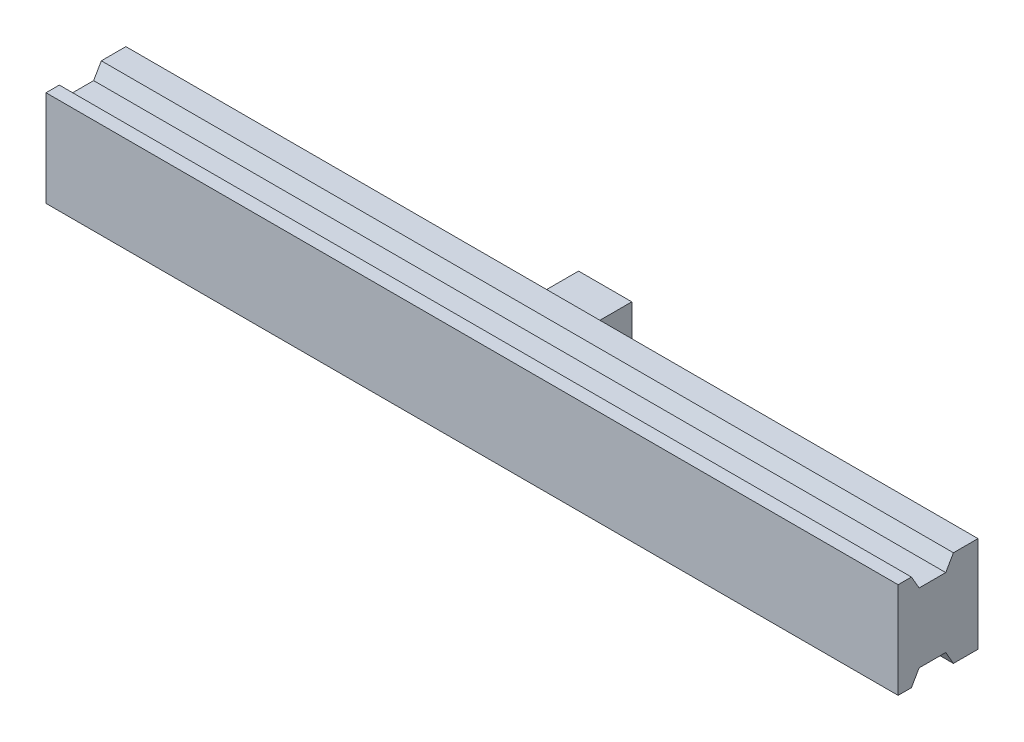
ISO-10303-21;
HEADER;
FILE_DESCRIPTION(('STEP AP214'),'2;1');
FILE_NAME('part.step','',(''),(''),'','','');
FILE_SCHEMA(('AUTOMOTIVE_DESIGN { 1 0 10303 214 1 1 1 1 }'));
ENDSEC;
DATA;
#1=APPLICATION_CONTEXT('core data for automotive mechanical design processes');
#2=APPLICATION_PROTOCOL_DEFINITION('international standard','automotive_design',2000,#1);
#3=PRODUCT_CONTEXT('',#1,'mechanical');
#4=PRODUCT('Part','Part','',(#3));
#5=PRODUCT_RELATED_PRODUCT_CATEGORY('part','',(#4));
#6=PRODUCT_DEFINITION_FORMATION('','',#4);
#7=PRODUCT_DEFINITION_CONTEXT('part definition',#1,'design');
#8=PRODUCT_DEFINITION('design','',#6,#7);
#9=PRODUCT_DEFINITION_SHAPE('','',#8);
#10=(LENGTH_UNIT() NAMED_UNIT(*) SI_UNIT(.MILLI.,.METRE.));
#11=(NAMED_UNIT(*) PLANE_ANGLE_UNIT() SI_UNIT($,.RADIAN.));
#12=(NAMED_UNIT(*) SI_UNIT($,.STERADIAN.) SOLID_ANGLE_UNIT());
#13=UNCERTAINTY_MEASURE_WITH_UNIT(LENGTH_MEASURE(1.E-05),#10,'distance_accuracy_value','');
#14=(GEOMETRIC_REPRESENTATION_CONTEXT(3) GLOBAL_UNCERTAINTY_ASSIGNED_CONTEXT((#13)) GLOBAL_UNIT_ASSIGNED_CONTEXT((#10,
#11,#12)) REPRESENTATION_CONTEXT('',''));
#15=CARTESIAN_POINT('',(0.,0.,0.));
#16=DIRECTION('',(0.,0.,1.));
#17=DIRECTION('',(1.,0.,0.));
#18=AXIS2_PLACEMENT_3D('',#15,#16,#17);
#19=CARTESIAN_POINT('',(0.,0.,0.));
#20=DIRECTION('',(0.,0.,1.));
#21=DIRECTION('',(1.,0.,0.));
#22=AXIS2_PLACEMENT_3D('',#19,#20,#21);
#23=PLANE('',#22);
#24=DIRECTION('',(0.,1.,0.));
#25=VECTOR('',#24,1.);
#26=CARTESIAN_POINT('',(495.087037167305,98.3824206282716,0.));
#27=LINE('',#26,#25);
#28=CARTESIAN_POINT('',(495.087037167305,80.3824206282716,0.));
#29=VERTEX_POINT('',#28);
#30=CARTESIAN_POINT('',(495.087037167305,98.3824206282716,0.));
#31=VERTEX_POINT('',#30);
#32=EDGE_CURVE('E196',#29,#31,#27,.T.);
#33=ORIENTED_EDGE('',*,*,#32,.F.);
#34=DIRECTION('',(1.,0.,0.));
#35=VECTOR('',#34,1.);
#36=CARTESIAN_POINT('',(335.087037167305,80.3824206282716,0.));
#37=LINE('',#36,#35);
#38=CARTESIAN_POINT('',(335.087037167305,80.3824206282716,0.));
#39=VERTEX_POINT('',#38);
#40=EDGE_CURVE('E228',#39,#29,#37,.T.);
#41=ORIENTED_EDGE('',*,*,#40,.F.);
#42=DIRECTION('',(0.,-1.,0.));
#43=VECTOR('',#42,1.);
#44=CARTESIAN_POINT('',(335.087037167305,98.3824206282716,0.));
#45=LINE('',#44,#43);
#46=CARTESIAN_POINT('',(335.087037167305,98.3824206282716,0.));
#47=VERTEX_POINT('',#46);
#48=EDGE_CURVE('E240',#47,#39,#45,.T.);
#49=ORIENTED_EDGE('',*,*,#48,.F.);
#50=DIRECTION('',(-1.,0.,0.));
#51=VECTOR('',#50,1.);
#52=CARTESIAN_POINT('',(335.087037167305,98.3824206282716,0.));
#53=LINE('',#52,#51);
#54=EDGE_CURVE('E237',#31,#47,#53,.T.);
#55=ORIENTED_EDGE('',*,*,#54,.F.);
#56=EDGE_LOOP('',(#33,#41,#49,#55));
#57=FACE_BOUND('',#56,.T.);
#58=DIRECTION('',(0.,1.,0.));
#59=VECTOR('',#58,1.);
#60=CARTESIAN_POINT('',(410.087037167305,94.3824206282716,0.));
#61=LINE('',#60,#59);
#62=CARTESIAN_POINT('',(410.087037167305,84.3824206282716,0.));
#63=VERTEX_POINT('',#62);
#64=CARTESIAN_POINT('',(410.087037167305,94.3824206282716,0.));
#65=VERTEX_POINT('',#64);
#66=EDGE_CURVE('E165',#63,#65,#61,.T.);
#67=ORIENTED_EDGE('',*,*,#66,.F.);
#68=DIRECTION('',(-1.,0.,0.));
#69=VECTOR('',#68,1.);
#70=CARTESIAN_POINT('',(420.087037167305,84.3824206282716,0.));
#71=LINE('',#70,#69);
#72=CARTESIAN_POINT('',(420.087037167305,84.3824206282716,0.));
#73=VERTEX_POINT('',#72);
#74=EDGE_CURVE('E162',#73,#63,#71,.T.);
#75=ORIENTED_EDGE('',*,*,#74,.F.);
#76=DIRECTION('',(0.,-1.,0.));
#77=VECTOR('',#76,1.);
#78=CARTESIAN_POINT('',(420.087037167305,94.3824206282716,0.));
#79=LINE('',#78,#77);
#80=CARTESIAN_POINT('',(420.087037167305,94.3824206282716,0.));
#81=VERTEX_POINT('',#80);
#82=EDGE_CURVE('E52',#81,#73,#79,.T.);
#83=ORIENTED_EDGE('',*,*,#82,.F.);
#84=DIRECTION('',(1.,0.,0.));
#85=VECTOR('',#84,1.);
#86=CARTESIAN_POINT('',(420.087037167305,94.3824206282716,0.));
#87=LINE('',#86,#85);
#88=EDGE_CURVE('E47',#65,#81,#87,.T.);
#89=ORIENTED_EDGE('',*,*,#88,.F.);
#90=EDGE_LOOP('',(#67,#75,#83,#89));
#91=FACE_BOUND('',#90,.T.);
#92=ADVANCED_FACE('F32',(#57,#91),#23,.F.);
#93=CARTESIAN_POINT('',(335.087037167305,98.3824206282716,15.));
#94=DIRECTION('',(0.,-1.,0.));
#95=DIRECTION('',(0.,0.,-1.));
#96=AXIS2_PLACEMENT_3D('',#93,#94,#95);
#97=PLANE('',#96);
#98=DIRECTION('',(0.,0.,-1.));
#99=VECTOR('',#98,1.);
#100=CARTESIAN_POINT('',(335.087037167305,98.3824206282716,15.));
#101=LINE('',#100,#99);
#102=CARTESIAN_POINT('',(335.087037167305,98.3824206282716,4.61324865405185));
#103=VERTEX_POINT('',#102);
#104=EDGE_CURVE('E251',#103,#47,#101,.T.);
#105=ORIENTED_EDGE('',*,*,#104,.F.);
#106=DIRECTION('',(1.,0.,0.));
#107=VECTOR('',#106,1.);
#108=CARTESIAN_POINT('',(335.087037167305,98.3824206282716,4.61324865405185));
#109=LINE('',#108,#107);
#110=CARTESIAN_POINT('',(495.087037167305,98.3824206282716,4.61324865405185));
#111=VERTEX_POINT('',#110);
#112=EDGE_CURVE('E193',#103,#111,#109,.T.);
#113=ORIENTED_EDGE('',*,*,#112,.T.);
#114=DIRECTION('',(0.,0.,-1.));
#115=VECTOR('',#114,1.);
#116=CARTESIAN_POINT('',(495.087037167305,98.3824206282716,15.));
#117=LINE('',#116,#115);
#118=EDGE_CURVE('E40',#111,#31,#117,.T.);
#119=ORIENTED_EDGE('',*,*,#118,.T.);
#120=ORIENTED_EDGE('',*,*,#54,.T.);
#121=EDGE_LOOP('',(#105,#113,#119,#120));
#122=FACE_BOUND('',#121,.T.);
#123=ADVANCED_FACE('F265',(#122),#97,.F.);
#124=CARTESIAN_POINT('',(335.087037167305,80.3824206282716,15.));
#125=DIRECTION('',(0.,1.,0.));
#126=DIRECTION('',(0.,0.,1.));
#127=AXIS2_PLACEMENT_3D('',#124,#125,#126);
#128=PLANE('',#127);
#129=DIRECTION('',(0.,0.,-1.));
#130=VECTOR('',#129,1.);
#131=CARTESIAN_POINT('',(335.087037167305,80.3824206282716,15.));
#132=LINE('',#131,#130);
#133=CARTESIAN_POINT('',(335.087037167305,80.3824206282716,15.));
#134=VERTEX_POINT('',#133);
#135=CARTESIAN_POINT('',(335.087037167305,80.3824206282716,12.5));
#136=VERTEX_POINT('',#135);
#137=EDGE_CURVE('E249',#134,#136,#132,.T.);
#138=ORIENTED_EDGE('',*,*,#137,.T.);
#139=DIRECTION('',(1.,0.,0.));
#140=VECTOR('',#139,1.);
#141=CARTESIAN_POINT('',(335.087037167305,80.3824206282716,12.5));
#142=LINE('',#141,#140);
#143=CARTESIAN_POINT('',(495.087037167305,80.3824206282716,12.5));
#144=VERTEX_POINT('',#143);
#145=EDGE_CURVE('E211',#136,#144,#142,.T.);
#146=ORIENTED_EDGE('',*,*,#145,.T.);
#147=DIRECTION('',(0.,0.,-1.));
#148=VECTOR('',#147,1.);
#149=CARTESIAN_POINT('',(495.087037167305,80.3824206282716,15.));
#150=LINE('',#149,#148);
#151=CARTESIAN_POINT('',(495.087037167305,80.3824206282716,15.));
#152=VERTEX_POINT('',#151);
#153=EDGE_CURVE('E245',#152,#144,#150,.T.);
#154=ORIENTED_EDGE('',*,*,#153,.F.);
#155=DIRECTION('',(1.,0.,0.));
#156=VECTOR('',#155,1.);
#157=CARTESIAN_POINT('',(335.087037167305,80.3824206282716,15.));
#158=LINE('',#157,#156);
#159=EDGE_CURVE('E232',#134,#152,#158,.T.);
#160=ORIENTED_EDGE('',*,*,#159,.F.);
#161=EDGE_LOOP('',(#138,#146,#154,#160));
#162=FACE_BOUND('',#161,.T.);
#163=ADVANCED_FACE('F287',(#162),#128,.F.);
#164=CARTESIAN_POINT('',(495.087037167305,98.3824206282716,15.));
#165=DIRECTION('',(-1.,0.,0.));
#166=DIRECTION('',(0.,0.,1.));
#167=AXIS2_PLACEMENT_3D('',#164,#165,#166);
#168=PLANE('',#167);
#169=ORIENTED_EDGE('',*,*,#118,.F.);
#170=DIRECTION('',(0.,0.866025403784436,-0.500000000000004));
#171=VECTOR('',#170,1.);
#172=CARTESIAN_POINT('',(495.087037167305,95.8824206282716,6.05662432702593));
#173=LINE('',#172,#171);
#174=CARTESIAN_POINT('',(495.087037167305,95.8824206282716,6.05662432702593));
#175=VERTEX_POINT('',#174);
#176=EDGE_CURVE('E178',#175,#111,#173,.T.);
#177=ORIENTED_EDGE('',*,*,#176,.F.);
#178=DIRECTION('',(0.,0.,-1.));
#179=VECTOR('',#178,1.);
#180=CARTESIAN_POINT('',(495.087037167305,95.8824206282716,11.0566243270259));
#181=LINE('',#180,#179);
#182=CARTESIAN_POINT('',(495.087037167305,95.8824206282716,11.0566243270259));
#183=VERTEX_POINT('',#182);
#184=EDGE_CURVE('E188',#183,#175,#181,.T.);
#185=ORIENTED_EDGE('',*,*,#184,.F.);
#186=DIRECTION('',(0.,-0.866025403784437,-0.500000000000002));
#187=VECTOR('',#186,1.);
#188=CARTESIAN_POINT('',(495.087037167305,98.3824206282716,12.5));
#189=LINE('',#188,#187);
#190=CARTESIAN_POINT('',(495.087037167305,98.3824206282716,12.5));
#191=VERTEX_POINT('',#190);
#192=EDGE_CURVE('E185',#191,#183,#189,.T.);
#193=ORIENTED_EDGE('',*,*,#192,.F.);
#194=CARTESIAN_POINT('',(495.087037167305,98.3824206282716,15.));
#195=VERTEX_POINT('',#194);
#196=EDGE_CURVE('E11',#195,#191,#117,.T.);
#197=ORIENTED_EDGE('',*,*,#196,.F.);
#198=DIRECTION('',(0.,1.,0.));
#199=VECTOR('',#198,1.);
#200=CARTESIAN_POINT('',(495.087037167305,98.3824206282716,15.));
#201=LINE('',#200,#199);
#202=EDGE_CURVE('E224',#152,#195,#201,.T.);
#203=ORIENTED_EDGE('',*,*,#202,.F.);
#204=ORIENTED_EDGE('',*,*,#153,.T.);
#205=DIRECTION('',(0.,-0.866025403784438,0.500000000000001));
#206=VECTOR('',#205,1.);
#207=CARTESIAN_POINT('',(495.087037167305,80.3824206282716,12.5));
#208=LINE('',#207,#206);
#209=CARTESIAN_POINT('',(495.087037167305,82.8824206282717,11.0566243270259));
#210=VERTEX_POINT('',#209);
#211=EDGE_CURVE('E166',#210,#144,#208,.T.);
#212=ORIENTED_EDGE('',*,*,#211,.F.);
#213=DIRECTION('',(0.,0.,1.));
#214=VECTOR('',#213,1.);
#215=CARTESIAN_POINT('',(495.087037167305,82.8824206282717,11.0566243270259));
#216=LINE('',#215,#214);
#217=CARTESIAN_POINT('',(495.087037167305,82.8824206282717,6.05662432702593));
#218=VERTEX_POINT('',#217);
#219=EDGE_CURVE('E206',#218,#210,#216,.T.);
#220=ORIENTED_EDGE('',*,*,#219,.F.);
#221=DIRECTION('',(0.,0.866025403784436,0.500000000000005));
#222=VECTOR('',#221,1.);
#223=CARTESIAN_POINT('',(495.087037167305,82.8824206282717,6.05662432702593));
#224=LINE('',#223,#222);
#225=CARTESIAN_POINT('',(495.087037167305,80.3824206282716,4.61324865405185));
#226=VERTEX_POINT('',#225);
#227=EDGE_CURVE('E168',#226,#218,#224,.T.);
#228=ORIENTED_EDGE('',*,*,#227,.F.);
#229=EDGE_CURVE('E234',#226,#29,#150,.T.);
#230=ORIENTED_EDGE('',*,*,#229,.T.);
#231=ORIENTED_EDGE('',*,*,#32,.T.);
#232=EDGE_LOOP('',(#169,#177,#185,#193,#197,#203,#204,#212,#220,#228,#230,#231));
#233=FACE_BOUND('',#232,.T.);
#234=ADVANCED_FACE('F34',(#233),#168,.F.);
#235=ORIENTED_EDGE('',*,*,#196,.T.);
#236=DIRECTION('',(1.,0.,0.));
#237=VECTOR('',#236,1.);
#238=CARTESIAN_POINT('',(335.087037167305,98.3824206282716,12.5));
#239=LINE('',#238,#237);
#240=CARTESIAN_POINT('',(335.087037167305,98.3824206282716,12.5));
#241=VERTEX_POINT('',#240);
#242=EDGE_CURVE('E184',#241,#191,#239,.T.);
#243=ORIENTED_EDGE('',*,*,#242,.F.);
#244=CARTESIAN_POINT('',(335.087037167305,98.3824206282716,15.));
#245=VERTEX_POINT('',#244);
#246=EDGE_CURVE('E252',#245,#241,#101,.T.);
#247=ORIENTED_EDGE('',*,*,#246,.F.);
#248=DIRECTION('',(-1.,0.,0.));
#249=VECTOR('',#248,1.);
#250=CARTESIAN_POINT('',(335.087037167305,98.3824206282716,15.));
#251=LINE('',#250,#249);
#252=EDGE_CURVE('E227',#195,#245,#251,.T.);
#253=ORIENTED_EDGE('',*,*,#252,.F.);
#254=EDGE_LOOP('',(#235,#243,#247,#253));
#255=FACE_BOUND('',#254,.T.);
#256=ADVANCED_FACE('F295',(#255),#97,.F.);
#257=CARTESIAN_POINT('',(335.087037167305,98.3824206282716,15.));
#258=DIRECTION('',(1.,0.,0.));
#259=DIRECTION('',(0.,1.,0.));
#260=AXIS2_PLACEMENT_3D('',#257,#258,#259);
#261=PLANE('',#260);
#262=DIRECTION('',(0.,0.,-1.));
#263=VECTOR('',#262,1.);
#264=CARTESIAN_POINT('',(335.087037167305,95.8824206282716,11.0566243270259));
#265=LINE('',#264,#263);
#266=CARTESIAN_POINT('',(335.087037167305,95.8824206282716,11.0566243270259));
#267=VERTEX_POINT('',#266);
#268=CARTESIAN_POINT('',(335.087037167305,95.8824206282716,6.05662432702593));
#269=VERTEX_POINT('',#268);
#270=EDGE_CURVE('E177',#267,#269,#265,.T.);
#271=ORIENTED_EDGE('',*,*,#270,.T.);
#272=DIRECTION('',(0.,0.866025403784436,-0.500000000000004));
#273=VECTOR('',#272,1.);
#274=CARTESIAN_POINT('',(335.087037167305,95.8824206282716,6.05662432702593));
#275=LINE('',#274,#273);
#276=EDGE_CURVE('E181',#269,#103,#275,.T.);
#277=ORIENTED_EDGE('',*,*,#276,.T.);
#278=ORIENTED_EDGE('',*,*,#104,.T.);
#279=ORIENTED_EDGE('',*,*,#48,.T.);
#280=CARTESIAN_POINT('',(335.087037167305,80.3824206282716,4.61324865405185));
#281=VERTEX_POINT('',#280);
#282=EDGE_CURVE('E248',#281,#39,#132,.T.);
#283=ORIENTED_EDGE('',*,*,#282,.F.);
#284=DIRECTION('',(0.,0.866025403784436,0.500000000000005));
#285=VECTOR('',#284,1.);
#286=CARTESIAN_POINT('',(335.087037167305,82.8824206282717,6.05662432702593));
#287=LINE('',#286,#285);
#288=CARTESIAN_POINT('',(335.087037167305,82.8824206282717,6.05662432702593));
#289=VERTEX_POINT('',#288);
#290=EDGE_CURVE('E205',#281,#289,#287,.T.);
#291=ORIENTED_EDGE('',*,*,#290,.T.);
#292=DIRECTION('',(0.,0.,1.));
#293=VECTOR('',#292,1.);
#294=CARTESIAN_POINT('',(335.087037167305,82.8824206282717,11.0566243270259));
#295=LINE('',#294,#293);
#296=CARTESIAN_POINT('',(335.087037167305,82.8824206282717,11.0566243270259));
#297=VERTEX_POINT('',#296);
#298=EDGE_CURVE('E209',#289,#297,#295,.T.);
#299=ORIENTED_EDGE('',*,*,#298,.T.);
#300=DIRECTION('',(0.,-0.866025403784438,0.500000000000001));
#301=VECTOR('',#300,1.);
#302=CARTESIAN_POINT('',(335.087037167305,80.3824206282716,12.5));
#303=LINE('',#302,#301);
#304=EDGE_CURVE('E202',#297,#136,#303,.T.);
#305=ORIENTED_EDGE('',*,*,#304,.T.);
#306=ORIENTED_EDGE('',*,*,#137,.F.);
#307=DIRECTION('',(0.,-1.,0.));
#308=VECTOR('',#307,1.);
#309=CARTESIAN_POINT('',(335.087037167305,98.3824206282716,15.));
#310=LINE('',#309,#308);
#311=EDGE_CURVE('E230',#245,#134,#310,.T.);
#312=ORIENTED_EDGE('',*,*,#311,.F.);
#313=ORIENTED_EDGE('',*,*,#246,.T.);
#314=DIRECTION('',(0.,-0.866025403784437,-0.500000000000002));
#315=VECTOR('',#314,1.);
#316=CARTESIAN_POINT('',(335.087037167305,98.3824206282716,12.5));
#317=LINE('',#316,#315);
#318=EDGE_CURVE('E174',#241,#267,#317,.T.);
#319=ORIENTED_EDGE('',*,*,#318,.T.);
#320=EDGE_LOOP('',(#271,#277,#278,#279,#283,#291,#299,#305,#306,#312,#313,#319));
#321=FACE_BOUND('',#320,.T.);
#322=ADVANCED_FACE('F258',(#321),#261,.F.);
#323=ORIENTED_EDGE('',*,*,#229,.F.);
#324=DIRECTION('',(1.,0.,0.));
#325=VECTOR('',#324,1.);
#326=CARTESIAN_POINT('',(335.087037167305,80.3824206282716,4.61324865405185));
#327=LINE('',#326,#325);
#328=EDGE_CURVE('E220',#281,#226,#327,.T.);
#329=ORIENTED_EDGE('',*,*,#328,.F.);
#330=ORIENTED_EDGE('',*,*,#282,.T.);
#331=ORIENTED_EDGE('',*,*,#40,.T.);
#332=EDGE_LOOP('',(#323,#329,#330,#331));
#333=FACE_BOUND('',#332,.T.);
#334=ADVANCED_FACE('F271',(#333),#128,.F.);
#335=CARTESIAN_POINT('',(0.,0.,15.));
#336=DIRECTION('',(0.,0.,1.));
#337=DIRECTION('',(1.,0.,0.));
#338=AXIS2_PLACEMENT_3D('',#335,#336,#337);
#339=PLANE('',#338);
#340=ORIENTED_EDGE('',*,*,#202,.T.);
#341=ORIENTED_EDGE('',*,*,#252,.T.);
#342=ORIENTED_EDGE('',*,*,#311,.T.);
#343=ORIENTED_EDGE('',*,*,#159,.T.);
#344=EDGE_LOOP('',(#340,#341,#342,#343));
#345=FACE_BOUND('',#344,.T.);
#346=ADVANCED_FACE('F291',(#345),#339,.T.);
#347=CARTESIAN_POINT('',(335.087037167305,80.3824206282716,12.5));
#348=DIRECTION('',(0.,0.500000000000001,0.866025403784438));
#349=DIRECTION('',(0.,-0.866025403784438,0.500000000000001));
#350=AXIS2_PLACEMENT_3D('',#347,#348,#349);
#351=PLANE('',#350);
#352=ORIENTED_EDGE('',*,*,#211,.T.);
#353=ORIENTED_EDGE('',*,*,#145,.F.);
#354=ORIENTED_EDGE('',*,*,#304,.F.);
#355=DIRECTION('',(1.,0.,0.));
#356=VECTOR('',#355,1.);
#357=CARTESIAN_POINT('',(335.087037167305,82.8824206282717,11.0566243270259));
#358=LINE('',#357,#356);
#359=EDGE_CURVE('E189',#297,#210,#358,.T.);
#360=ORIENTED_EDGE('',*,*,#359,.T.);
#361=EDGE_LOOP('',(#352,#353,#354,#360));
#362=FACE_BOUND('',#361,.T.);
#363=ADVANCED_FACE('F283',(#362),#351,.F.);
#364=CARTESIAN_POINT('',(335.087037167305,82.8824206282717,11.0566243270259));
#365=DIRECTION('',(0.,1.,0.));
#366=DIRECTION('',(0.,0.,1.));
#367=AXIS2_PLACEMENT_3D('',#364,#365,#366);
#368=PLANE('',#367);
#369=ORIENTED_EDGE('',*,*,#219,.T.);
#370=ORIENTED_EDGE('',*,*,#359,.F.);
#371=ORIENTED_EDGE('',*,*,#298,.F.);
#372=DIRECTION('',(1.,0.,0.));
#373=VECTOR('',#372,1.);
#374=CARTESIAN_POINT('',(335.087037167305,82.8824206282717,6.05662432702593));
#375=LINE('',#374,#373);
#376=EDGE_CURVE('E218',#289,#218,#375,.T.);
#377=ORIENTED_EDGE('',*,*,#376,.T.);
#378=EDGE_LOOP('',(#369,#370,#371,#377));
#379=FACE_BOUND('',#378,.T.);
#380=ADVANCED_FACE('F279',(#379),#368,.F.);
#381=CARTESIAN_POINT('',(335.087037167305,82.8824206282717,6.05662432702593));
#382=DIRECTION('',(0.,0.500000000000005,-0.866025403784436));
#383=DIRECTION('',(0.,0.866025403784436,0.500000000000005));
#384=AXIS2_PLACEMENT_3D('',#381,#382,#383);
#385=PLANE('',#384);
#386=ORIENTED_EDGE('',*,*,#227,.T.);
#387=ORIENTED_EDGE('',*,*,#376,.F.);
#388=ORIENTED_EDGE('',*,*,#290,.F.);
#389=ORIENTED_EDGE('',*,*,#328,.T.);
#390=EDGE_LOOP('',(#386,#387,#388,#389));
#391=FACE_BOUND('',#390,.T.);
#392=ADVANCED_FACE('F275',(#391),#385,.F.);
#393=CARTESIAN_POINT('',(335.087037167305,95.8824206282716,6.05662432702593));
#394=DIRECTION('',(0.,-0.500000000000004,-0.866025403784436));
#395=DIRECTION('',(0.,0.866025403784436,-0.500000000000004));
#396=AXIS2_PLACEMENT_3D('',#393,#394,#395);
#397=PLANE('',#396);
#398=ORIENTED_EDGE('',*,*,#176,.T.);
#399=ORIENTED_EDGE('',*,*,#112,.F.);
#400=ORIENTED_EDGE('',*,*,#276,.F.);
#401=DIRECTION('',(1.,0.,0.));
#402=VECTOR('',#401,1.);
#403=CARTESIAN_POINT('',(335.087037167305,95.8824206282716,6.05662432702593));
#404=LINE('',#403,#402);
#405=EDGE_CURVE('E197',#269,#175,#404,.T.);
#406=ORIENTED_EDGE('',*,*,#405,.T.);
#407=EDGE_LOOP('',(#398,#399,#400,#406));
#408=FACE_BOUND('',#407,.T.);
#409=ADVANCED_FACE('F306',(#408),#397,.F.);
#410=CARTESIAN_POINT('',(335.087037167305,95.8824206282716,11.0566243270259));
#411=DIRECTION('',(0.,-1.,0.));
#412=DIRECTION('',(0.,0.,-1.));
#413=AXIS2_PLACEMENT_3D('',#410,#411,#412);
#414=PLANE('',#413);
#415=ORIENTED_EDGE('',*,*,#184,.T.);
#416=ORIENTED_EDGE('',*,*,#405,.F.);
#417=ORIENTED_EDGE('',*,*,#270,.F.);
#418=DIRECTION('',(1.,0.,0.));
#419=VECTOR('',#418,1.);
#420=CARTESIAN_POINT('',(335.087037167305,95.8824206282716,11.0566243270259));
#421=LINE('',#420,#419);
#422=EDGE_CURVE('E199',#267,#183,#421,.T.);
#423=ORIENTED_EDGE('',*,*,#422,.T.);
#424=EDGE_LOOP('',(#415,#416,#417,#423));
#425=FACE_BOUND('',#424,.T.);
#426=ADVANCED_FACE('F304',(#425),#414,.F.);
#427=CARTESIAN_POINT('',(335.087037167305,98.3824206282716,12.5));
#428=DIRECTION('',(0.,-0.500000000000002,0.866025403784437));
#429=DIRECTION('',(0.,-0.866025403784437,-0.500000000000002));
#430=AXIS2_PLACEMENT_3D('',#427,#428,#429);
#431=PLANE('',#430);
#432=ORIENTED_EDGE('',*,*,#192,.T.);
#433=ORIENTED_EDGE('',*,*,#422,.F.);
#434=ORIENTED_EDGE('',*,*,#318,.F.);
#435=ORIENTED_EDGE('',*,*,#242,.T.);
#436=EDGE_LOOP('',(#432,#433,#434,#435));
#437=FACE_BOUND('',#436,.T.);
#438=ADVANCED_FACE('F298',(#437),#431,.F.);
#439=CARTESIAN_POINT('',(410.087037167305,94.3824206282716,-10.));
#440=DIRECTION('',(1.,0.,0.));
#441=DIRECTION('',(0.,0.,-1.));
#442=AXIS2_PLACEMENT_3D('',#439,#440,#441);
#443=PLANE('',#442);
#444=ORIENTED_EDGE('',*,*,#66,.T.);
#445=DIRECTION('',(0.,0.,1.));
#446=VECTOR('',#445,1.);
#447=CARTESIAN_POINT('',(410.087037167305,94.3824206282716,-10.));
#448=LINE('',#447,#446);
#449=CARTESIAN_POINT('',(410.087037167305,94.3824206282716,-10.));
#450=VERTEX_POINT('',#449);
#451=EDGE_CURVE('E146',#450,#65,#448,.T.);
#452=ORIENTED_EDGE('',*,*,#451,.F.);
#453=DIRECTION('',(0.,1.,0.));
#454=VECTOR('',#453,1.);
#455=CARTESIAN_POINT('',(410.087037167305,94.3824206282716,-10.));
#456=LINE('',#455,#454);
#457=CARTESIAN_POINT('',(410.087037167305,84.3824206282716,-10.));
#458=VERTEX_POINT('',#457);
#459=EDGE_CURVE('E153',#458,#450,#456,.T.);
#460=ORIENTED_EDGE('',*,*,#459,.F.);
#461=DIRECTION('',(0.,0.,1.));
#462=VECTOR('',#461,1.);
#463=CARTESIAN_POINT('',(410.087037167305,84.3824206282716,-10.));
#464=LINE('',#463,#462);
#465=EDGE_CURVE('E438',#458,#63,#464,.T.);
#466=ORIENTED_EDGE('',*,*,#465,.T.);
#467=EDGE_LOOP('',(#444,#452,#460,#466));
#468=FACE_BOUND('',#467,.T.);
#469=ADVANCED_FACE('F164',(#468),#443,.F.);
#470=CARTESIAN_POINT('',(420.087037167305,94.3824206282716,-10.));
#471=DIRECTION('',(0.,-1.,0.));
#472=DIRECTION('',(0.,0.,-1.));
#473=AXIS2_PLACEMENT_3D('',#470,#471,#472);
#474=PLANE('',#473);
#475=ORIENTED_EDGE('',*,*,#88,.T.);
#476=DIRECTION('',(0.,0.,1.));
#477=VECTOR('',#476,1.);
#478=CARTESIAN_POINT('',(420.087037167305,94.3824206282716,-10.));
#479=LINE('',#478,#477);
#480=CARTESIAN_POINT('',(420.087037167305,94.3824206282716,-10.));
#481=VERTEX_POINT('',#480);
#482=EDGE_CURVE('E149',#481,#81,#479,.T.);
#483=ORIENTED_EDGE('',*,*,#482,.F.);
#484=DIRECTION('',(1.,0.,0.));
#485=VECTOR('',#484,1.);
#486=CARTESIAN_POINT('',(420.087037167305,94.3824206282716,-10.));
#487=LINE('',#486,#485);
#488=EDGE_CURVE('E142',#450,#481,#487,.T.);
#489=ORIENTED_EDGE('',*,*,#488,.F.);
#490=ORIENTED_EDGE('',*,*,#451,.T.);
#491=EDGE_LOOP('',(#475,#483,#489,#490));
#492=FACE_BOUND('',#491,.T.);
#493=ADVANCED_FACE('F144',(#492),#474,.F.);
#494=CARTESIAN_POINT('',(420.087037167305,94.3824206282716,-10.));
#495=DIRECTION('',(-1.,0.,0.));
#496=DIRECTION('',(0.,0.,1.));
#497=AXIS2_PLACEMENT_3D('',#494,#495,#496);
#498=PLANE('',#497);
#499=ORIENTED_EDGE('',*,*,#82,.T.);
#500=DIRECTION('',(0.,0.,1.));
#501=VECTOR('',#500,1.);
#502=CARTESIAN_POINT('',(420.087037167305,84.3824206282716,-10.));
#503=LINE('',#502,#501);
#504=CARTESIAN_POINT('',(420.087037167305,84.3824206282716,-10.));
#505=VERTEX_POINT('',#504);
#506=EDGE_CURVE('E170',#505,#73,#503,.T.);
#507=ORIENTED_EDGE('',*,*,#506,.F.);
#508=DIRECTION('',(0.,-1.,0.));
#509=VECTOR('',#508,1.);
#510=CARTESIAN_POINT('',(420.087037167305,94.3824206282716,-10.));
#511=LINE('',#510,#509);
#512=EDGE_CURVE('E152',#481,#505,#511,.T.);
#513=ORIENTED_EDGE('',*,*,#512,.F.);
#514=ORIENTED_EDGE('',*,*,#482,.T.);
#515=EDGE_LOOP('',(#499,#507,#513,#514));
#516=FACE_BOUND('',#515,.T.);
#517=ADVANCED_FACE('F405',(#516),#498,.F.);
#518=CARTESIAN_POINT('',(420.087037167305,84.3824206282716,-10.));
#519=DIRECTION('',(0.,1.,0.));
#520=DIRECTION('',(0.,0.,1.));
#521=AXIS2_PLACEMENT_3D('',#518,#519,#520);
#522=PLANE('',#521);
#523=ORIENTED_EDGE('',*,*,#74,.T.);
#524=ORIENTED_EDGE('',*,*,#465,.F.);
#525=DIRECTION('',(-1.,0.,0.));
#526=VECTOR('',#525,1.);
#527=CARTESIAN_POINT('',(420.087037167305,84.3824206282716,-10.));
#528=LINE('',#527,#526);
#529=EDGE_CURVE('E158',#505,#458,#528,.T.);
#530=ORIENTED_EDGE('',*,*,#529,.F.);
#531=ORIENTED_EDGE('',*,*,#506,.T.);
#532=EDGE_LOOP('',(#523,#524,#530,#531));
#533=FACE_BOUND('',#532,.T.);
#534=ADVANCED_FACE('F414',(#533),#522,.F.);
#535=CARTESIAN_POINT('',(0.,0.,-10.));
#536=DIRECTION('',(0.,0.,-1.));
#537=DIRECTION('',(-1.,0.,0.));
#538=AXIS2_PLACEMENT_3D('',#535,#536,#537);
#539=PLANE('',#538);
#540=ORIENTED_EDGE('',*,*,#459,.T.);
#541=ORIENTED_EDGE('',*,*,#488,.T.);
#542=ORIENTED_EDGE('',*,*,#512,.T.);
#543=ORIENTED_EDGE('',*,*,#529,.T.);
#544=EDGE_LOOP('',(#540,#541,#542,#543));
#545=FACE_BOUND('',#544,.T.);
#546=ADVANCED_FACE('F156',(#545),#539,.T.);
#547=CLOSED_SHELL('',(#92,#123,#163,#234,#256,#322,#334,#346,#363,#380,#392,#409,#426,#438,#469,
#493,#517,#534,#546));
#548=MANIFOLD_SOLID_BREP('B2',#547);
#549=ADVANCED_BREP_SHAPE_REPRESENTATION('',(#18,#548),#14);
#550=SHAPE_DEFINITION_REPRESENTATION(#9,#549);
ENDSEC;
END-ISO-10303-21;
